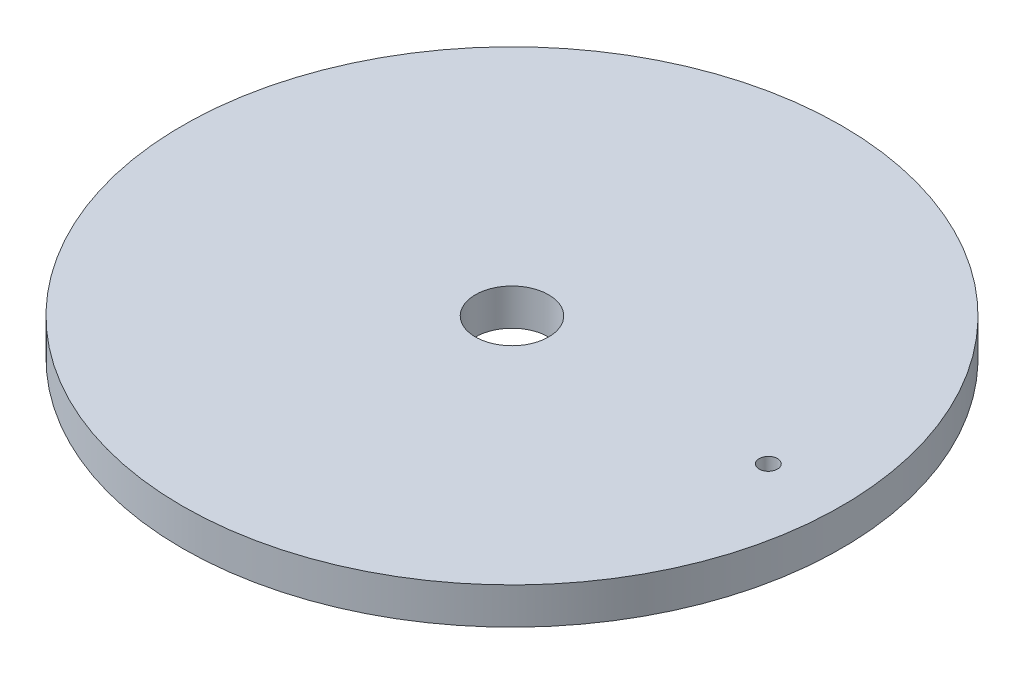
ISO-10303-21;
HEADER;
FILE_DESCRIPTION(('STEP AP214'),'2;1');
FILE_NAME('part.step','',(''),(''),'','','');
FILE_SCHEMA(('AUTOMOTIVE_DESIGN { 1 0 10303 214 1 1 1 1 }'));
ENDSEC;
DATA;
#1=APPLICATION_CONTEXT('core data for automotive mechanical design processes');
#2=APPLICATION_PROTOCOL_DEFINITION('international standard','automotive_design',2000,#1);
#3=PRODUCT_CONTEXT('',#1,'mechanical');
#4=PRODUCT('Part','Part','',(#3));
#5=PRODUCT_RELATED_PRODUCT_CATEGORY('part','',(#4));
#6=PRODUCT_DEFINITION_FORMATION('','',#4);
#7=PRODUCT_DEFINITION_CONTEXT('part definition',#1,'design');
#8=PRODUCT_DEFINITION('design','',#6,#7);
#9=PRODUCT_DEFINITION_SHAPE('','',#8);
#10=(LENGTH_UNIT() NAMED_UNIT(*) SI_UNIT(.MILLI.,.METRE.));
#11=(NAMED_UNIT(*) PLANE_ANGLE_UNIT() SI_UNIT($,.RADIAN.));
#12=(NAMED_UNIT(*) SI_UNIT($,.STERADIAN.) SOLID_ANGLE_UNIT());
#13=UNCERTAINTY_MEASURE_WITH_UNIT(LENGTH_MEASURE(1.E-05),#10,'distance_accuracy_value','');
#14=(GEOMETRIC_REPRESENTATION_CONTEXT(3) GLOBAL_UNCERTAINTY_ASSIGNED_CONTEXT((#13)) GLOBAL_UNIT_ASSIGNED_CONTEXT((#10,
#11,#12)) REPRESENTATION_CONTEXT('',''));
#15=CARTESIAN_POINT('',(0.,0.,0.));
#16=DIRECTION('',(0.,0.,1.));
#17=DIRECTION('',(1.,0.,0.));
#18=AXIS2_PLACEMENT_3D('',#15,#16,#17);
#19=CARTESIAN_POINT('',(0.,0.,0.));
#20=DIRECTION('',(0.,-1.,0.));
#21=DIRECTION('',(0.,0.,-1.));
#22=AXIS2_PLACEMENT_3D('',#19,#20,#21);
#23=CYLINDRICAL_SURFACE('',#22,6.35);
#24=CARTESIAN_POINT('',(0.,6.35,0.));
#25=DIRECTION('',(0.,-1.,0.));
#26=DIRECTION('',(0.,0.,-1.));
#27=AXIS2_PLACEMENT_3D('',#24,#25,#26);
#28=CIRCLE('',#27,6.35);
#29=CARTESIAN_POINT('',(0.,6.35,-6.35));
#30=VERTEX_POINT('',#29);
#31=EDGE_CURVE('E59',#30,#30,#28,.T.);
#32=ORIENTED_EDGE('',*,*,#31,.F.);
#33=EDGE_LOOP('',(#32));
#34=FACE_BOUND('',#33,.T.);
#35=CARTESIAN_POINT('',(0.,0.,0.));
#36=DIRECTION('',(0.,-1.,0.));
#37=DIRECTION('',(0.,0.,-1.));
#38=AXIS2_PLACEMENT_3D('',#35,#36,#37);
#39=CIRCLE('',#38,6.35);
#40=CARTESIAN_POINT('',(0.,0.,-6.35));
#41=VERTEX_POINT('',#40);
#42=EDGE_CURVE('E11',#41,#41,#39,.T.);
#43=ORIENTED_EDGE('',*,*,#42,.T.);
#44=EDGE_LOOP('',(#43));
#45=FACE_BOUND('',#44,.T.);
#46=ADVANCED_FACE('F38',(#34,#45),#23,.F.);
#47=CARTESIAN_POINT('',(-6.35,0.,0.));
#48=DIRECTION('',(0.,1.,0.));
#49=DIRECTION('',(0.,0.,1.));
#50=AXIS2_PLACEMENT_3D('',#47,#48,#49);
#51=PLANE('',#50);
#52=ORIENTED_EDGE('',*,*,#42,.F.);
#53=EDGE_LOOP('',(#52));
#54=FACE_BOUND('',#53,.T.);
#55=CARTESIAN_POINT('',(0.,0.,0.));
#56=DIRECTION('',(0.,-1.,0.));
#57=DIRECTION('',(0.,0.,-1.));
#58=AXIS2_PLACEMENT_3D('',#55,#56,#57);
#59=CIRCLE('',#58,52.5145);
#60=CARTESIAN_POINT('',(0.,0.,-52.5145));
#61=VERTEX_POINT('',#60);
#62=EDGE_CURVE('E45',#61,#61,#59,.T.);
#63=ORIENTED_EDGE('',*,*,#62,.T.);
#64=EDGE_LOOP('',(#63));
#65=FACE_BOUND('',#64,.T.);
#66=ADVANCED_FACE('F92',(#54,#65),#51,.F.);
#67=CARTESIAN_POINT('',(0.,0.,0.));
#68=DIRECTION('',(0.,-1.,0.));
#69=DIRECTION('',(0.,0.,-1.));
#70=AXIS2_PLACEMENT_3D('',#67,#68,#69);
#71=CYLINDRICAL_SURFACE('',#70,52.5145);
#72=ORIENTED_EDGE('',*,*,#62,.F.);
#73=EDGE_LOOP('',(#72));
#74=FACE_BOUND('',#73,.T.);
#75=CARTESIAN_POINT('',(0.,2.03199999999999,0.));
#76=DIRECTION('',(0.,-1.,0.));
#77=DIRECTION('',(0.,0.,-1.));
#78=AXIS2_PLACEMENT_3D('',#75,#76,#77);
#79=CIRCLE('',#78,52.5145);
#80=CARTESIAN_POINT('',(0.,2.03199999999999,-52.5145));
#81=VERTEX_POINT('',#80);
#82=EDGE_CURVE('E85',#81,#81,#79,.T.);
#83=ORIENTED_EDGE('',*,*,#82,.T.);
#84=EDGE_LOOP('',(#83));
#85=FACE_BOUND('',#84,.T.);
#86=ADVANCED_FACE('F94',(#74,#85),#71,.T.);
#87=CARTESIAN_POINT('',(-55.5625,2.03199999999999,0.));
#88=DIRECTION('',(0.,1.,0.));
#89=DIRECTION('',(0.,0.,1.));
#90=AXIS2_PLACEMENT_3D('',#87,#88,#89);
#91=PLANE('',#90);
#92=ORIENTED_EDGE('',*,*,#82,.F.);
#93=EDGE_LOOP('',(#92));
#94=FACE_BOUND('',#93,.T.);
#95=CARTESIAN_POINT('',(0.,2.03199999999999,0.));
#96=DIRECTION('',(0.,-1.,0.));
#97=DIRECTION('',(0.,0.,-1.));
#98=AXIS2_PLACEMENT_3D('',#95,#96,#97);
#99=CIRCLE('',#98,55.5625);
#100=CARTESIAN_POINT('',(0.,2.03199999999999,-55.5625));
#101=VERTEX_POINT('',#100);
#102=EDGE_CURVE('E81',#101,#101,#99,.T.);
#103=ORIENTED_EDGE('',*,*,#102,.T.);
#104=EDGE_LOOP('',(#103));
#105=FACE_BOUND('',#104,.T.);
#106=ADVANCED_FACE('F97',(#94,#105),#91,.F.);
#107=CARTESIAN_POINT('',(0.,0.,0.));
#108=DIRECTION('',(0.,-1.,0.));
#109=DIRECTION('',(0.,0.,-1.));
#110=AXIS2_PLACEMENT_3D('',#107,#108,#109);
#111=CYLINDRICAL_SURFACE('',#110,55.5625);
#112=ORIENTED_EDGE('',*,*,#102,.F.);
#113=EDGE_LOOP('',(#112));
#114=FACE_BOUND('',#113,.T.);
#115=CARTESIAN_POINT('',(0.,0.,0.));
#116=DIRECTION('',(0.,-1.,0.));
#117=DIRECTION('',(0.,0.,-1.));
#118=AXIS2_PLACEMENT_3D('',#115,#116,#117);
#119=CIRCLE('',#118,55.5625);
#120=CARTESIAN_POINT('',(0.,0.,-55.5625));
#121=VERTEX_POINT('',#120);
#122=EDGE_CURVE('E77',#121,#121,#119,.T.);
#123=ORIENTED_EDGE('',*,*,#122,.T.);
#124=EDGE_LOOP('',(#123));
#125=FACE_BOUND('',#124,.T.);
#126=ADVANCED_FACE('F103',(#114,#125),#111,.F.);
#127=CARTESIAN_POINT('',(-57.15,0.,0.));
#128=DIRECTION('',(0.,1.,0.));
#129=DIRECTION('',(0.,0.,1.));
#130=AXIS2_PLACEMENT_3D('',#127,#128,#129);
#131=PLANE('',#130);
#132=ORIENTED_EDGE('',*,*,#122,.F.);
#133=EDGE_LOOP('',(#132));
#134=FACE_BOUND('',#133,.T.);
#135=CARTESIAN_POINT('',(0.,0.,0.));
#136=DIRECTION('',(0.,-1.,0.));
#137=DIRECTION('',(0.,0.,-1.));
#138=AXIS2_PLACEMENT_3D('',#135,#136,#137);
#139=CIRCLE('',#138,57.15);
#140=CARTESIAN_POINT('',(0.,0.,-57.15));
#141=VERTEX_POINT('',#140);
#142=EDGE_CURVE('E73',#141,#141,#139,.T.);
#143=ORIENTED_EDGE('',*,*,#142,.T.);
#144=EDGE_LOOP('',(#143));
#145=FACE_BOUND('',#144,.T.);
#146=ADVANCED_FACE('F109',(#134,#145),#131,.F.);
#147=CARTESIAN_POINT('',(0.,0.,0.));
#148=DIRECTION('',(0.,-1.,0.));
#149=DIRECTION('',(0.,0.,-1.));
#150=AXIS2_PLACEMENT_3D('',#147,#148,#149);
#151=CYLINDRICAL_SURFACE('',#150,57.15);
#152=ORIENTED_EDGE('',*,*,#142,.F.);
#153=EDGE_LOOP('',(#152));
#154=FACE_BOUND('',#153,.T.);
#155=CARTESIAN_POINT('',(0.,6.34999999999999,0.));
#156=DIRECTION('',(0.,-1.,0.));
#157=DIRECTION('',(0.,0.,-1.));
#158=AXIS2_PLACEMENT_3D('',#155,#156,#157);
#159=CIRCLE('',#158,57.15);
#160=CARTESIAN_POINT('',(0.,6.34999999999999,-57.15));
#161=VERTEX_POINT('',#160);
#162=EDGE_CURVE('E65',#161,#161,#159,.T.);
#163=ORIENTED_EDGE('',*,*,#162,.T.);
#164=EDGE_LOOP('',(#163));
#165=FACE_BOUND('',#164,.T.);
#166=ADVANCED_FACE('F115',(#154,#165),#151,.T.);
#167=CARTESIAN_POINT('',(-57.15,6.35,0.));
#168=DIRECTION('',(0.,-1.,0.));
#169=DIRECTION('',(0.,0.,-1.));
#170=AXIS2_PLACEMENT_3D('',#167,#168,#169);
#171=PLANE('',#170);
#172=CARTESIAN_POINT('',(44.45,6.35,0.));
#173=DIRECTION('',(0.,1.,0.));
#174=DIRECTION('',(0.,0.,1.));
#175=AXIS2_PLACEMENT_3D('',#172,#173,#174);
#176=CIRCLE('',#175,1.58749999999999);
#177=CARTESIAN_POINT('',(44.45,6.35,1.58749999999999));
#178=VERTEX_POINT('',#177);
#179=EDGE_CURVE('E60',#178,#178,#176,.T.);
#180=ORIENTED_EDGE('',*,*,#179,.F.);
#181=EDGE_LOOP('',(#180));
#182=FACE_BOUND('',#181,.T.);
#183=ORIENTED_EDGE('',*,*,#162,.F.);
#184=EDGE_LOOP('',(#183));
#185=FACE_BOUND('',#184,.T.);
#186=ORIENTED_EDGE('',*,*,#31,.T.);
#187=EDGE_LOOP('',(#186));
#188=FACE_BOUND('',#187,.T.);
#189=ADVANCED_FACE('F52',(#182,#185,#188),#171,.F.);
#190=CARTESIAN_POINT('',(44.45,3.048,0.));
#191=DIRECTION('',(0.,1.,0.));
#192=DIRECTION('',(0.,0.,1.));
#193=AXIS2_PLACEMENT_3D('',#190,#191,#192);
#194=CONICAL_SURFACE('',#193,1.58749999999998,1.02974425867665);
#195=CARTESIAN_POINT('',(44.45,2.09413376729374,0.));
#196=VERTEX_POINT('',#195);
#197=VERTEX_LOOP('',#196);
#198=FACE_BOUND('',#197,.T.);
#199=CARTESIAN_POINT('',(44.45,3.048,0.));
#200=DIRECTION('',(0.,1.,0.));
#201=DIRECTION('',(0.,0.,1.));
#202=AXIS2_PLACEMENT_3D('',#199,#200,#201);
#203=CIRCLE('',#202,1.58749999999998);
#204=CARTESIAN_POINT('',(44.45,3.048,1.58749999999998));
#205=VERTEX_POINT('',#204);
#206=EDGE_CURVE('E56',#205,#205,#203,.T.);
#207=ORIENTED_EDGE('',*,*,#206,.T.);
#208=EDGE_LOOP('',(#207));
#209=FACE_BOUND('',#208,.T.);
#210=ADVANCED_FACE('F48',(#198,#209),#194,.F.);
#211=CARTESIAN_POINT('',(44.45,6.35,0.));
#212=DIRECTION('',(0.,1.,0.));
#213=DIRECTION('',(0.,0.,1.));
#214=AXIS2_PLACEMENT_3D('',#211,#212,#213);
#215=CYLINDRICAL_SURFACE('',#214,1.58749999999999);
#216=ORIENTED_EDGE('',*,*,#206,.F.);
#217=EDGE_LOOP('',(#216));
#218=FACE_BOUND('',#217,.T.);
#219=ORIENTED_EDGE('',*,*,#179,.T.);
#220=EDGE_LOOP('',(#219));
#221=FACE_BOUND('',#220,.T.);
#222=ADVANCED_FACE('F51',(#218,#221),#215,.F.);
#223=CLOSED_SHELL('',(#46,#66,#86,#106,#126,#146,#166,#189,#210,#222));
#224=MANIFOLD_SOLID_BREP('B2',#223);
#225=ADVANCED_BREP_SHAPE_REPRESENTATION('',(#18,#224),#14);
#226=SHAPE_DEFINITION_REPRESENTATION(#9,#225);
ENDSEC;
END-ISO-10303-21;
